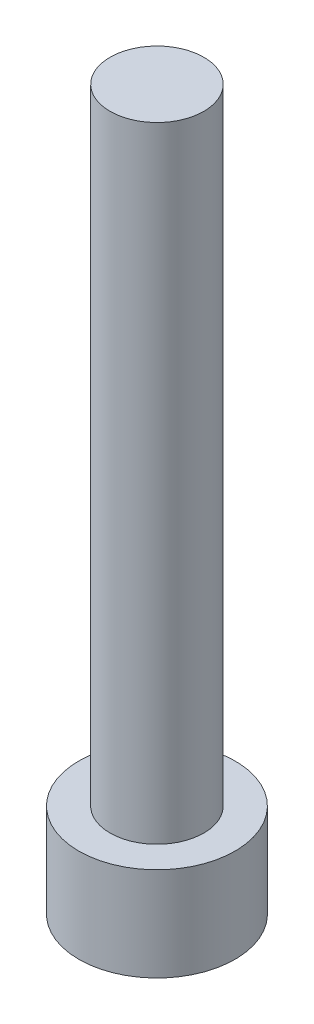
ISO-10303-21;
HEADER;
FILE_DESCRIPTION(('STEP AP214'),'2;1');
FILE_NAME('part.step','',(''),(''),'','','');
FILE_SCHEMA(('AUTOMOTIVE_DESIGN { 1 0 10303 214 1 1 1 1 }'));
ENDSEC;
DATA;
#1=APPLICATION_CONTEXT('core data for automotive mechanical design processes');
#2=APPLICATION_PROTOCOL_DEFINITION('international standard','automotive_design',2000,#1);
#3=PRODUCT_CONTEXT('',#1,'mechanical');
#4=PRODUCT('Part','Part','',(#3));
#5=PRODUCT_RELATED_PRODUCT_CATEGORY('part','',(#4));
#6=PRODUCT_DEFINITION_FORMATION('','',#4);
#7=PRODUCT_DEFINITION_CONTEXT('part definition',#1,'design');
#8=PRODUCT_DEFINITION('design','',#6,#7);
#9=PRODUCT_DEFINITION_SHAPE('','',#8);
#10=(LENGTH_UNIT() NAMED_UNIT(*) SI_UNIT(.MILLI.,.METRE.));
#11=(NAMED_UNIT(*) PLANE_ANGLE_UNIT() SI_UNIT($,.RADIAN.));
#12=(NAMED_UNIT(*) SI_UNIT($,.STERADIAN.) SOLID_ANGLE_UNIT());
#13=UNCERTAINTY_MEASURE_WITH_UNIT(LENGTH_MEASURE(1.E-05),#10,'distance_accuracy_value','');
#14=(GEOMETRIC_REPRESENTATION_CONTEXT(3) GLOBAL_UNCERTAINTY_ASSIGNED_CONTEXT((#13)) GLOBAL_UNIT_ASSIGNED_CONTEXT((#10,
#11,#12)) REPRESENTATION_CONTEXT('',''));
#15=CARTESIAN_POINT('',(0.,0.,0.));
#16=DIRECTION('',(0.,0.,1.));
#17=DIRECTION('',(1.,0.,0.));
#18=AXIS2_PLACEMENT_3D('',#15,#16,#17);
#19=CARTESIAN_POINT('',(0.,3.,0.));
#20=DIRECTION('',(0.,-1.,0.));
#21=DIRECTION('',(0.,0.,-1.));
#22=AXIS2_PLACEMENT_3D('',#19,#20,#21);
#23=CYLINDRICAL_SURFACE('',#22,2.5);
#24=CARTESIAN_POINT('',(0.,3.,0.));
#25=DIRECTION('',(0.,1.,0.));
#26=DIRECTION('',(0.,0.,1.));
#27=AXIS2_PLACEMENT_3D('',#24,#25,#26);
#28=CIRCLE('',#27,2.5);
#29=CARTESIAN_POINT('',(0.,3.,2.5));
#30=VERTEX_POINT('',#29);
#31=EDGE_CURVE('E43',#30,#30,#28,.T.);
#32=ORIENTED_EDGE('',*,*,#31,.F.);
#33=EDGE_LOOP('',(#32));
#34=FACE_BOUND('',#33,.T.);
#35=CARTESIAN_POINT('',(0.,0.,0.));
#36=DIRECTION('',(0.,1.,0.));
#37=DIRECTION('',(0.,0.,1.));
#38=AXIS2_PLACEMENT_3D('',#35,#36,#37);
#39=CIRCLE('',#38,2.5);
#40=CARTESIAN_POINT('',(0.,0.,2.5));
#41=VERTEX_POINT('',#40);
#42=EDGE_CURVE('E38',#41,#41,#39,.T.);
#43=ORIENTED_EDGE('',*,*,#42,.T.);
#44=EDGE_LOOP('',(#43));
#45=FACE_BOUND('',#44,.T.);
#46=ADVANCED_FACE('F35',(#34,#45),#23,.T.);
#47=CARTESIAN_POINT('',(0.,3.,0.));
#48=DIRECTION('',(0.,1.,0.));
#49=DIRECTION('',(0.,0.,1.));
#50=AXIS2_PLACEMENT_3D('',#47,#48,#49);
#51=PLANE('',#50);
#52=CARTESIAN_POINT('',(0.,3.,0.));
#53=DIRECTION('',(0.,1.,0.));
#54=DIRECTION('',(0.,0.,1.));
#55=AXIS2_PLACEMENT_3D('',#52,#53,#54);
#56=CIRCLE('',#55,1.5);
#57=CARTESIAN_POINT('',(0.,3.,1.5));
#58=VERTEX_POINT('',#57);
#59=EDGE_CURVE('E11',#58,#58,#56,.T.);
#60=ORIENTED_EDGE('',*,*,#59,.F.);
#61=EDGE_LOOP('',(#60));
#62=FACE_BOUND('',#61,.T.);
#63=ORIENTED_EDGE('',*,*,#31,.T.);
#64=EDGE_LOOP('',(#63));
#65=FACE_BOUND('',#64,.T.);
#66=ADVANCED_FACE('F155',(#62,#65),#51,.T.);
#67=CARTESIAN_POINT('',(0.,0.,0.));
#68=DIRECTION('',(0.,1.,0.));
#69=DIRECTION('',(0.,0.,1.));
#70=AXIS2_PLACEMENT_3D('',#67,#68,#69);
#71=PLANE('',#70);
#72=DIRECTION('',(-0.5,0.,0.866025403784439));
#73=VECTOR('',#72,1.);
#74=CARTESIAN_POINT('',(1.425,0.,0.));
#75=LINE('',#74,#73);
#76=CARTESIAN_POINT('',(1.425,0.,0.));
#77=VERTEX_POINT('',#76);
#78=CARTESIAN_POINT('',(0.7125,0.,1.23408620039283));
#79=VERTEX_POINT('',#78);
#80=EDGE_CURVE('E125',#77,#79,#75,.T.);
#81=ORIENTED_EDGE('',*,*,#80,.F.);
#82=DIRECTION('',(0.5,0.,0.866025403784439));
#83=VECTOR('',#82,1.);
#84=CARTESIAN_POINT('',(0.7125,0.,-1.23408620039283));
#85=LINE('',#84,#83);
#86=CARTESIAN_POINT('',(0.7125,0.,-1.23408620039283));
#87=VERTEX_POINT('',#86);
#88=EDGE_CURVE('E51',#87,#77,#85,.T.);
#89=ORIENTED_EDGE('',*,*,#88,.F.);
#90=DIRECTION('',(1.,0.,0.));
#91=VECTOR('',#90,1.);
#92=CARTESIAN_POINT('',(-0.7125,0.,-1.23408620039283));
#93=LINE('',#92,#91);
#94=CARTESIAN_POINT('',(-0.7125,0.,-1.23408620039283));
#95=VERTEX_POINT('',#94);
#96=EDGE_CURVE('E134',#95,#87,#93,.T.);
#97=ORIENTED_EDGE('',*,*,#96,.F.);
#98=DIRECTION('',(0.5,0.,-0.866025403784439));
#99=VECTOR('',#98,1.);
#100=CARTESIAN_POINT('',(-1.425,0.,0.));
#101=LINE('',#100,#99);
#102=CARTESIAN_POINT('',(-1.425,0.,0.));
#103=VERTEX_POINT('',#102);
#104=EDGE_CURVE('E132',#103,#95,#101,.T.);
#105=ORIENTED_EDGE('',*,*,#104,.F.);
#106=DIRECTION('',(-0.5,0.,-0.866025403784439));
#107=VECTOR('',#106,1.);
#108=CARTESIAN_POINT('',(-0.7125,0.,1.23408620039283));
#109=LINE('',#108,#107);
#110=CARTESIAN_POINT('',(-0.7125,0.,1.23408620039283));
#111=VERTEX_POINT('',#110);
#112=EDGE_CURVE('E99',#111,#103,#109,.T.);
#113=ORIENTED_EDGE('',*,*,#112,.F.);
#114=DIRECTION('',(-1.,0.,0.));
#115=VECTOR('',#114,1.);
#116=CARTESIAN_POINT('',(0.7125,0.,1.23408620039283));
#117=LINE('',#116,#115);
#118=EDGE_CURVE('E128',#79,#111,#117,.T.);
#119=ORIENTED_EDGE('',*,*,#118,.F.);
#120=EDGE_LOOP('',(#81,#89,#97,#105,#113,#119));
#121=FACE_BOUND('',#120,.T.);
#122=ORIENTED_EDGE('',*,*,#42,.F.);
#123=EDGE_LOOP('',(#122));
#124=FACE_BOUND('',#123,.T.);
#125=ADVANCED_FACE('F152',(#121,#124),#71,.F.);
#126=CARTESIAN_POINT('',(0.,23.,0.));
#127=DIRECTION('',(0.,-1.,0.));
#128=DIRECTION('',(0.,0.,-1.));
#129=AXIS2_PLACEMENT_3D('',#126,#127,#128);
#130=CYLINDRICAL_SURFACE('',#129,1.5);
#131=CARTESIAN_POINT('',(0.,23.,0.));
#132=DIRECTION('',(0.,1.,0.));
#133=DIRECTION('',(0.,0.,1.));
#134=AXIS2_PLACEMENT_3D('',#131,#132,#133);
#135=CIRCLE('',#134,1.5);
#136=CARTESIAN_POINT('',(0.,23.,1.5));
#137=VERTEX_POINT('',#136);
#138=EDGE_CURVE('E138',#137,#137,#135,.T.);
#139=ORIENTED_EDGE('',*,*,#138,.F.);
#140=EDGE_LOOP('',(#139));
#141=FACE_BOUND('',#140,.T.);
#142=ORIENTED_EDGE('',*,*,#59,.T.);
#143=EDGE_LOOP('',(#142));
#144=FACE_BOUND('',#143,.T.);
#145=ADVANCED_FACE('F154',(#141,#144),#130,.T.);
#146=CARTESIAN_POINT('',(0.,23.,0.));
#147=DIRECTION('',(0.,1.,0.));
#148=DIRECTION('',(0.,0.,1.));
#149=AXIS2_PLACEMENT_3D('',#146,#147,#148);
#150=PLANE('',#149);
#151=ORIENTED_EDGE('',*,*,#138,.T.);
#152=EDGE_LOOP('',(#151));
#153=FACE_BOUND('',#152,.T.);
#154=ADVANCED_FACE('F161',(#153),#150,.T.);
#155=CARTESIAN_POINT('',(0.7125,1.65,-1.23408620039283));
#156=DIRECTION('',(0.866025403784439,0.,-0.5));
#157=DIRECTION('',(-0.5,0.,-0.866025403784439));
#158=AXIS2_PLACEMENT_3D('',#155,#156,#157);
#159=PLANE('',#158);
#160=ORIENTED_EDGE('',*,*,#88,.T.);
#161=DIRECTION('',(0.,-1.,0.));
#162=VECTOR('',#161,1.);
#163=CARTESIAN_POINT('',(1.425,1.65,0.));
#164=LINE('',#163,#162);
#165=CARTESIAN_POINT('',(1.425,1.65,0.));
#166=VERTEX_POINT('',#165);
#167=EDGE_CURVE('E81',#166,#77,#164,.T.);
#168=ORIENTED_EDGE('',*,*,#167,.F.);
#169=DIRECTION('',(0.5,0.,0.866025403784439));
#170=VECTOR('',#169,1.);
#171=CARTESIAN_POINT('',(0.7125,1.65,-1.23408620039283));
#172=LINE('',#171,#170);
#173=CARTESIAN_POINT('',(0.7125,1.65,-1.23408620039283));
#174=VERTEX_POINT('',#173);
#175=EDGE_CURVE('E136',#174,#166,#172,.T.);
#176=ORIENTED_EDGE('',*,*,#175,.F.);
#177=DIRECTION('',(0.,-1.,0.));
#178=VECTOR('',#177,1.);
#179=CARTESIAN_POINT('',(0.7125,1.65,-1.23408620039283));
#180=LINE('',#179,#178);
#181=EDGE_CURVE('E59',#174,#87,#180,.T.);
#182=ORIENTED_EDGE('',*,*,#181,.T.);
#183=EDGE_LOOP('',(#160,#168,#176,#182));
#184=FACE_BOUND('',#183,.T.);
#185=ADVANCED_FACE('F190',(#184),#159,.F.);
#186=CARTESIAN_POINT('',(-0.7125,1.65,-1.23408620039283));
#187=DIRECTION('',(0.,0.,-1.));
#188=DIRECTION('',(-1.,0.,0.));
#189=AXIS2_PLACEMENT_3D('',#186,#187,#188);
#190=PLANE('',#189);
#191=ORIENTED_EDGE('',*,*,#96,.T.);
#192=ORIENTED_EDGE('',*,*,#181,.F.);
#193=DIRECTION('',(1.,0.,0.));
#194=VECTOR('',#193,1.);
#195=CARTESIAN_POINT('',(-0.7125,1.65,-1.23408620039283));
#196=LINE('',#195,#194);
#197=CARTESIAN_POINT('',(-0.7125,1.65,-1.23408620039283));
#198=VERTEX_POINT('',#197);
#199=EDGE_CURVE('E111',#198,#174,#196,.T.);
#200=ORIENTED_EDGE('',*,*,#199,.F.);
#201=DIRECTION('',(0.,-1.,0.));
#202=VECTOR('',#201,1.);
#203=CARTESIAN_POINT('',(-0.7125,1.65,-1.23408620039283));
#204=LINE('',#203,#202);
#205=EDGE_CURVE('E103',#198,#95,#204,.T.);
#206=ORIENTED_EDGE('',*,*,#205,.T.);
#207=EDGE_LOOP('',(#191,#192,#200,#206));
#208=FACE_BOUND('',#207,.T.);
#209=ADVANCED_FACE('F204',(#208),#190,.F.);
#210=CARTESIAN_POINT('',(-1.425,1.65,0.));
#211=DIRECTION('',(-0.866025403784439,0.,-0.5));
#212=DIRECTION('',(-0.5,0.,0.866025403784439));
#213=AXIS2_PLACEMENT_3D('',#210,#211,#212);
#214=PLANE('',#213);
#215=ORIENTED_EDGE('',*,*,#104,.T.);
#216=ORIENTED_EDGE('',*,*,#205,.F.);
#217=DIRECTION('',(0.5,0.,-0.866025403784439));
#218=VECTOR('',#217,1.);
#219=CARTESIAN_POINT('',(-1.425,1.65,0.));
#220=LINE('',#219,#218);
#221=CARTESIAN_POINT('',(-1.425,1.65,0.));
#222=VERTEX_POINT('',#221);
#223=EDGE_CURVE('E107',#222,#198,#220,.T.);
#224=ORIENTED_EDGE('',*,*,#223,.F.);
#225=DIRECTION('',(0.,-1.,0.));
#226=VECTOR('',#225,1.);
#227=CARTESIAN_POINT('',(-1.425,1.65,0.));
#228=LINE('',#227,#226);
#229=EDGE_CURVE('E92',#222,#103,#228,.T.);
#230=ORIENTED_EDGE('',*,*,#229,.T.);
#231=EDGE_LOOP('',(#215,#216,#224,#230));
#232=FACE_BOUND('',#231,.T.);
#233=ADVANCED_FACE('F108',(#232),#214,.F.);
#234=CARTESIAN_POINT('',(-0.7125,1.65,1.23408620039283));
#235=DIRECTION('',(-0.866025403784439,0.,0.5));
#236=DIRECTION('',(0.5,0.,0.866025403784439));
#237=AXIS2_PLACEMENT_3D('',#234,#235,#236);
#238=PLANE('',#237);
#239=ORIENTED_EDGE('',*,*,#112,.T.);
#240=ORIENTED_EDGE('',*,*,#229,.F.);
#241=DIRECTION('',(-0.5,0.,-0.866025403784439));
#242=VECTOR('',#241,1.);
#243=CARTESIAN_POINT('',(-0.7125,1.65,1.23408620039283));
#244=LINE('',#243,#242);
#245=CARTESIAN_POINT('',(-0.7125,1.65,1.23408620039283));
#246=VERTEX_POINT('',#245);
#247=EDGE_CURVE('E96',#246,#222,#244,.T.);
#248=ORIENTED_EDGE('',*,*,#247,.F.);
#249=DIRECTION('',(0.,-1.,0.));
#250=VECTOR('',#249,1.);
#251=CARTESIAN_POINT('',(-0.7125,1.65,1.23408620039283));
#252=LINE('',#251,#250);
#253=EDGE_CURVE('E104',#246,#111,#252,.T.);
#254=ORIENTED_EDGE('',*,*,#253,.T.);
#255=EDGE_LOOP('',(#239,#240,#248,#254));
#256=FACE_BOUND('',#255,.T.);
#257=ADVANCED_FACE('F94',(#256),#238,.F.);
#258=CARTESIAN_POINT('',(0.7125,1.65,1.23408620039283));
#259=DIRECTION('',(0.,0.,1.));
#260=DIRECTION('',(1.,0.,0.));
#261=AXIS2_PLACEMENT_3D('',#258,#259,#260);
#262=PLANE('',#261);
#263=ORIENTED_EDGE('',*,*,#118,.T.);
#264=ORIENTED_EDGE('',*,*,#253,.F.);
#265=DIRECTION('',(-1.,0.,0.));
#266=VECTOR('',#265,1.);
#267=CARTESIAN_POINT('',(0.7125,1.65,1.23408620039283));
#268=LINE('',#267,#266);
#269=CARTESIAN_POINT('',(0.7125,1.65,1.23408620039283));
#270=VERTEX_POINT('',#269);
#271=EDGE_CURVE('E117',#270,#246,#268,.T.);
#272=ORIENTED_EDGE('',*,*,#271,.F.);
#273=DIRECTION('',(0.,-1.,0.));
#274=VECTOR('',#273,1.);
#275=CARTESIAN_POINT('',(0.7125,1.65,1.23408620039283));
#276=LINE('',#275,#274);
#277=EDGE_CURVE('E141',#270,#79,#276,.T.);
#278=ORIENTED_EDGE('',*,*,#277,.T.);
#279=EDGE_LOOP('',(#263,#264,#272,#278));
#280=FACE_BOUND('',#279,.T.);
#281=ADVANCED_FACE('F229',(#280),#262,.F.);
#282=CARTESIAN_POINT('',(1.425,1.65,0.));
#283=DIRECTION('',(0.866025403784439,0.,0.5));
#284=DIRECTION('',(0.5,0.,-0.866025403784438));
#285=AXIS2_PLACEMENT_3D('',#282,#283,#284);
#286=PLANE('',#285);
#287=ORIENTED_EDGE('',*,*,#80,.T.);
#288=ORIENTED_EDGE('',*,*,#277,.F.);
#289=DIRECTION('',(-0.5,0.,0.866025403784439));
#290=VECTOR('',#289,1.);
#291=CARTESIAN_POINT('',(1.425,1.65,0.));
#292=LINE('',#291,#290);
#293=EDGE_CURVE('E119',#166,#270,#292,.T.);
#294=ORIENTED_EDGE('',*,*,#293,.F.);
#295=ORIENTED_EDGE('',*,*,#167,.T.);
#296=EDGE_LOOP('',(#287,#288,#294,#295));
#297=FACE_BOUND('',#296,.T.);
#298=ADVANCED_FACE('F238',(#297),#286,.F.);
#299=CARTESIAN_POINT('',(0.,1.65,0.));
#300=DIRECTION('',(0.,-1.,0.));
#301=DIRECTION('',(0.,0.,-1.));
#302=AXIS2_PLACEMENT_3D('',#299,#300,#301);
#303=PLANE('',#302);
#304=ORIENTED_EDGE('',*,*,#175,.T.);
#305=ORIENTED_EDGE('',*,*,#293,.T.);
#306=ORIENTED_EDGE('',*,*,#271,.T.);
#307=ORIENTED_EDGE('',*,*,#247,.T.);
#308=ORIENTED_EDGE('',*,*,#223,.T.);
#309=ORIENTED_EDGE('',*,*,#199,.T.);
#310=EDGE_LOOP('',(#304,#305,#306,#307,#308,#309));
#311=FACE_BOUND('',#310,.T.);
#312=ADVANCED_FACE('F114',(#311),#303,.T.);
#313=CLOSED_SHELL('',(#46,#66,#125,#145,#154,#185,#209,#233,#257,#281,#298,#312));
#314=MANIFOLD_SOLID_BREP('B2',#313);
#315=ADVANCED_BREP_SHAPE_REPRESENTATION('',(#18,#314),#14);
#316=SHAPE_DEFINITION_REPRESENTATION(#9,#315);
ENDSEC;
END-ISO-10303-21;
